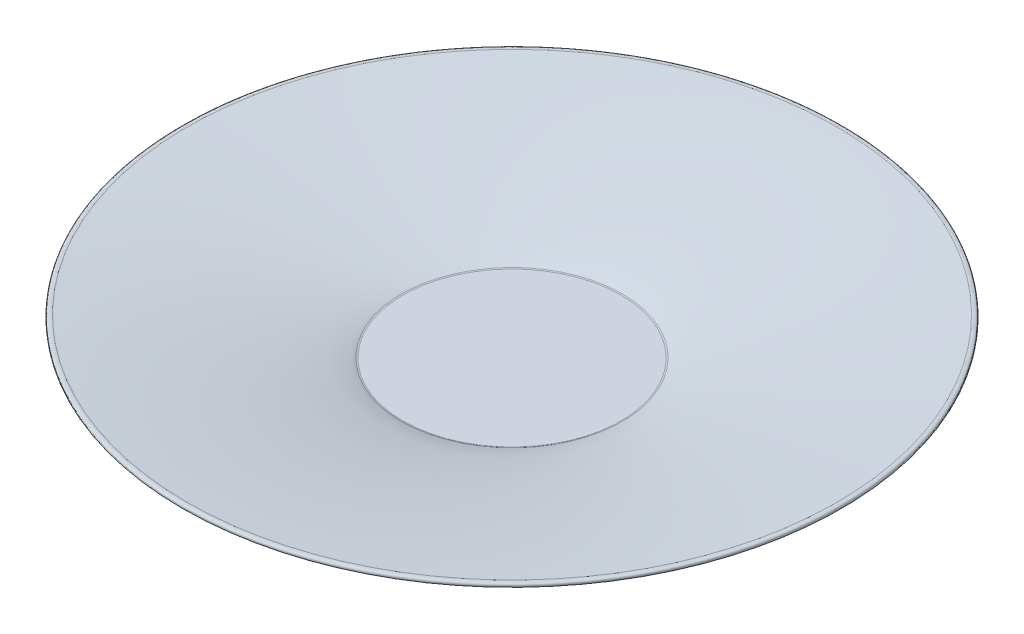
ISO-10303-21;
HEADER;
FILE_DESCRIPTION(('STEP AP214'),'2;1');
FILE_NAME('part.step','',(''),(''),'','','');
FILE_SCHEMA(('AUTOMOTIVE_DESIGN { 1 0 10303 214 1 1 1 1 }'));
ENDSEC;
DATA;
#1=APPLICATION_CONTEXT('core data for automotive mechanical design processes');
#2=APPLICATION_PROTOCOL_DEFINITION('international standard','automotive_design',2000,#1);
#3=PRODUCT_CONTEXT('',#1,'mechanical');
#4=PRODUCT('Part','Part','',(#3));
#5=PRODUCT_RELATED_PRODUCT_CATEGORY('part','',(#4));
#6=PRODUCT_DEFINITION_FORMATION('','',#4);
#7=PRODUCT_DEFINITION_CONTEXT('part definition',#1,'design');
#8=PRODUCT_DEFINITION('design','',#6,#7);
#9=PRODUCT_DEFINITION_SHAPE('','',#8);
#10=(LENGTH_UNIT() NAMED_UNIT(*) SI_UNIT(.MILLI.,.METRE.));
#11=(NAMED_UNIT(*) PLANE_ANGLE_UNIT() SI_UNIT($,.RADIAN.));
#12=(NAMED_UNIT(*) SI_UNIT($,.STERADIAN.) SOLID_ANGLE_UNIT());
#13=UNCERTAINTY_MEASURE_WITH_UNIT(LENGTH_MEASURE(1.E-05),#10,'distance_accuracy_value','');
#14=(GEOMETRIC_REPRESENTATION_CONTEXT(3) GLOBAL_UNCERTAINTY_ASSIGNED_CONTEXT((#13)) GLOBAL_UNIT_ASSIGNED_CONTEXT((#10,
#11,#12)) REPRESENTATION_CONTEXT('',''));
#15=CARTESIAN_POINT('',(0.,0.,0.));
#16=DIRECTION('',(0.,0.,1.));
#17=DIRECTION('',(1.,0.,0.));
#18=AXIS2_PLACEMENT_3D('',#15,#16,#17);
#19=CARTESIAN_POINT('',(74.,8.5333971986131,0.));
#20=CARTESIAN_POINT('',(74.,8.46943015980032,0.));
#21=CARTESIAN_POINT('',(50.,6.3585178789784,0.));
#22=CARTESIAN_POINT('',(28.,1.5609899680195,0.));
#23=CARTESIAN_POINT('',(25.,0.,0.));
#24=B_SPLINE_CURVE_WITH_KNOTS('',4,(#19,#20,#21,#22,#23),.UNSPECIFIED.,.F.,.F.,(5,5),(0.,1.),.UNSPECIFIED.);
#25=CARTESIAN_POINT('',(0.,0.,0.));
#26=DIRECTION('',(0.,1.,0.));
#27=AXIS1_PLACEMENT('',#25,#26);
#28=SURFACE_OF_REVOLUTION('',#24,#27);
#29=CARTESIAN_POINT('',(0.,0.0689929356605954,0.));
#30=DIRECTION('',(0.,1.,0.));
#31=DIRECTION('',(0.,0.,1.));
#32=AXIS2_PLACEMENT_3D('',#29,#30,#31);
#33=CIRCLE('',#32,25.1413428557363);
#34=CARTESIAN_POINT('',(0.,0.0689929356605954,25.1413428557363));
#35=VERTEX_POINT('',#34);
#36=EDGE_CURVE('E51',#35,#35,#33,.F.);
#37=ORIENTED_EDGE('',*,*,#36,.T.);
#38=EDGE_LOOP('',(#37));
#39=FACE_BOUND('',#38,.T.);
#40=CARTESIAN_POINT('',(0.,8.5333971986131,0.));
#41=DIRECTION('',(0.,1.,0.));
#42=DIRECTION('',(0.,0.,1.));
#43=AXIS2_PLACEMENT_3D('',#40,#41,#42);
#44=CIRCLE('',#43,74.);
#45=CARTESIAN_POINT('',(0.,8.5333971986131,74.));
#46=VERTEX_POINT('',#45);
#47=EDGE_CURVE('E63',#46,#46,#44,.T.);
#48=ORIENTED_EDGE('',*,*,#47,.T.);
#49=EDGE_LOOP('',(#48));
#50=FACE_BOUND('',#49,.T.);
#51=ADVANCED_FACE('F31',(#39,#50),#28,.T.);
#52=CARTESIAN_POINT('',(0.,0.,0.));
#53=DIRECTION('',(0.,-1.,0.));
#54=DIRECTION('',(0.,0.,-1.));
#55=AXIS2_PLACEMENT_3D('',#52,#53,#54);
#56=PLANE('',#55);
#57=CARTESIAN_POINT('',(0.,0.,0.));
#58=DIRECTION('',(0.,-1.,0.));
#59=DIRECTION('',(0.,0.,-1.));
#60=AXIS2_PLACEMENT_3D('',#57,#58,#59);
#61=CIRCLE('',#60,24.8271305416557);
#62=CARTESIAN_POINT('',(0.,0.,-24.8271305416557));
#63=VERTEX_POINT('',#62);
#64=EDGE_CURVE('E54',#63,#63,#61,.F.);
#65=ORIENTED_EDGE('',*,*,#64,.T.);
#66=EDGE_LOOP('',(#65));
#67=FACE_BOUND('',#66,.T.);
#68=ADVANCED_FACE('F90',(#67),#56,.F.);
#69=CARTESIAN_POINT('',(25.8,-2.37632158678537,0.));
#70=CARTESIAN_POINT('',(25.,-1.18816079339269,0.));
#71=CARTESIAN_POINT('',(28.3767436675306,0.582613406981976,0.));
#72=CARTESIAN_POINT('',(50.4,4.56627720167923,0.));
#73=CARTESIAN_POINT('',(75.,7.79785949853494,0.));
#74=B_SPLINE_CURVE_WITH_KNOTS('',4,(#69,#70,#71,#72,#73),.UNSPECIFIED.,.F.,.F.,(5,5),(0.,1.),.UNSPECIFIED.);
#75=CARTESIAN_POINT('',(0.,0.,0.));
#76=DIRECTION('',(0.,1.,0.));
#77=AXIS1_PLACEMENT('',#75,#76);
#78=SURFACE_OF_REVOLUTION('',#74,#77);
#79=CARTESIAN_POINT('',(0.,-1.14181524213187,0.));
#80=DIRECTION('',(0.,1.,0.));
#81=DIRECTION('',(0.,0.,1.));
#82=AXIS2_PLACEMENT_3D('',#79,#80,#81);
#83=CIRCLE('',#82,26.7723793104441);
#84=CARTESIAN_POINT('',(0.,-1.14181524213187,26.7723793104441));
#85=VERTEX_POINT('',#84);
#86=EDGE_CURVE('E46',#85,#85,#83,.T.);
#87=ORIENTED_EDGE('',*,*,#86,.T.);
#88=EDGE_LOOP('',(#87));
#89=FACE_BOUND('',#88,.T.);
#90=CARTESIAN_POINT('',(0.,7.79785949853494,0.));
#91=DIRECTION('',(0.,1.,0.));
#92=DIRECTION('',(0.,0.,1.));
#93=AXIS2_PLACEMENT_3D('',#90,#91,#92);
#94=CIRCLE('',#93,75.);
#95=CARTESIAN_POINT('',(0.,7.79785949853494,75.));
#96=VERTEX_POINT('',#95);
#97=EDGE_CURVE('E60',#96,#96,#94,.T.);
#98=ORIENTED_EDGE('',*,*,#97,.F.);
#99=EDGE_LOOP('',(#98));
#100=FACE_BOUND('',#99,.T.);
#101=ADVANCED_FACE('F84',(#89,#100),#78,.T.);
#102=CARTESIAN_POINT('',(75.,7.79785949853494,0.));
#103=CARTESIAN_POINT('',(75.233494481093,8.73624536404964,0.));
#104=CARTESIAN_POINT('',(74.,8.5333971986131,0.));
#105=B_SPLINE_CURVE_WITH_KNOTS('',2,(#102,#103,#104),.UNSPECIFIED.,.F.,.F.,(3,3),(0.,1.),.UNSPECIFIED.);
#106=CARTESIAN_POINT('',(0.,0.,0.));
#107=DIRECTION('',(0.,1.,0.));
#108=AXIS1_PLACEMENT('',#106,#107);
#109=SURFACE_OF_REVOLUTION('',#105,#108);
#110=ORIENTED_EDGE('',*,*,#47,.F.);
#111=EDGE_LOOP('',(#110));
#112=FACE_BOUND('',#111,.T.);
#113=ORIENTED_EDGE('',*,*,#97,.T.);
#114=EDGE_LOOP('',(#113));
#115=FACE_BOUND('',#114,.T.);
#116=ADVANCED_FACE('F79',(#112,#115),#109,.T.);
#117=CARTESIAN_POINT('',(0.,-4.37632158678537,0.));
#118=DIRECTION('',(0.,-1.,0.));
#119=DIRECTION('',(0.,0.,-1.));
#120=AXIS2_PLACEMENT_3D('',#117,#118,#119);
#121=PLANE('',#120);
#122=CARTESIAN_POINT('',(0.,-4.37632158678537,0.));
#123=DIRECTION('',(0.,-1.,0.));
#124=DIRECTION('',(0.,0.,-1.));
#125=AXIS2_PLACEMENT_3D('',#122,#123,#124);
#126=CIRCLE('',#125,27.);
#127=CARTESIAN_POINT('',(0.,-4.37632158678537,-27.));
#128=VERTEX_POINT('',#127);
#129=EDGE_CURVE('E109',#128,#128,#126,.T.);
#130=ORIENTED_EDGE('',*,*,#129,.F.);
#131=EDGE_LOOP('',(#130));
#132=FACE_BOUND('',#131,.T.);
#133=CARTESIAN_POINT('',(0.,-4.37632158678537,0.));
#134=DIRECTION('',(0.,-1.,0.));
#135=DIRECTION('',(0.,0.,-1.));
#136=AXIS2_PLACEMENT_3D('',#133,#134,#135);
#137=CIRCLE('',#136,30.);
#138=CARTESIAN_POINT('',(0.,-4.37632158678537,-30.));
#139=VERTEX_POINT('',#138);
#140=EDGE_CURVE('E66',#139,#139,#137,.T.);
#141=ORIENTED_EDGE('',*,*,#140,.T.);
#142=EDGE_LOOP('',(#141));
#143=FACE_BOUND('',#142,.T.);
#144=ADVANCED_FACE('F83',(#132,#143),#121,.T.);
#145=CARTESIAN_POINT('',(0.,-2.37632158678537,0.));
#146=DIRECTION('',(0.,-1.,0.));
#147=DIRECTION('',(0.,0.,-1.));
#148=AXIS2_PLACEMENT_3D('',#145,#146,#147);
#149=PLANE('',#148);
#150=CARTESIAN_POINT('',(0.,-2.37632158678537,0.));
#151=DIRECTION('',(0.,-1.,0.));
#152=DIRECTION('',(0.,0.,-1.));
#153=AXIS2_PLACEMENT_3D('',#150,#151,#152);
#154=CIRCLE('',#153,27.0567247571455);
#155=CARTESIAN_POINT('',(0.,-2.37632158678537,-27.0567247571455));
#156=VERTEX_POINT('',#155);
#157=EDGE_CURVE('E42',#156,#156,#154,.T.);
#158=ORIENTED_EDGE('',*,*,#157,.T.);
#159=EDGE_LOOP('',(#158));
#160=FACE_BOUND('',#159,.T.);
#161=CARTESIAN_POINT('',(0.,-2.37632158678537,0.));
#162=DIRECTION('',(0.,-1.,0.));
#163=DIRECTION('',(0.,0.,-1.));
#164=AXIS2_PLACEMENT_3D('',#161,#162,#163);
#165=CIRCLE('',#164,27.1715728752538);
#166=CARTESIAN_POINT('',(0.,-2.37632158678537,-27.1715728752538));
#167=VERTEX_POINT('',#166);
#168=EDGE_CURVE('E57',#167,#167,#165,.F.);
#169=ORIENTED_EDGE('',*,*,#168,.T.);
#170=EDGE_LOOP('',(#169));
#171=FACE_BOUND('',#170,.T.);
#172=ADVANCED_FACE('F86',(#160,#171),#149,.F.);
#173=CARTESIAN_POINT('',(0.,-5.37632158678537,0.));
#174=DIRECTION('',(0.,1.,0.));
#175=DIRECTION('',(0.,0.,1.));
#176=AXIS2_PLACEMENT_3D('',#173,#174,#175);
#177=TOROIDAL_SURFACE('',#176,27.1715728752538,3.);
#178=ORIENTED_EDGE('',*,*,#168,.F.);
#179=EDGE_LOOP('',(#178));
#180=FACE_BOUND('',#179,.T.);
#181=ORIENTED_EDGE('',*,*,#140,.F.);
#182=EDGE_LOOP('',(#181));
#183=FACE_BOUND('',#182,.T.);
#184=ADVANCED_FACE('F98',(#180,#183),#177,.T.);
#185=CARTESIAN_POINT('',(0.,0.749999999999999,0.));
#186=DIRECTION('',(0.,1.,0.));
#187=DIRECTION('',(0.,0.,1.));
#188=AXIS2_PLACEMENT_3D('',#185,#186,#187);
#189=TOROIDAL_SURFACE('',#188,24.8271305416557,0.75);
#190=ORIENTED_EDGE('',*,*,#36,.F.);
#191=EDGE_LOOP('',(#190));
#192=FACE_BOUND('',#191,.T.);
#193=ORIENTED_EDGE('',*,*,#64,.F.);
#194=EDGE_LOOP('',(#193));
#195=FACE_BOUND('',#194,.T.);
#196=ADVANCED_FACE('F120',(#192,#195),#189,.F.);
#197=CARTESIAN_POINT('',(0.,-1.72632158678537,0.));
#198=DIRECTION('',(0.,1.,0.));
#199=DIRECTION('',(0.,0.,1.));
#200=AXIS2_PLACEMENT_3D('',#197,#198,#199);
#201=TOROIDAL_SURFACE('',#200,27.0567247571455,0.65);
#202=ORIENTED_EDGE('',*,*,#157,.F.);
#203=EDGE_LOOP('',(#202));
#204=FACE_BOUND('',#203,.T.);
#205=ORIENTED_EDGE('',*,*,#86,.F.);
#206=EDGE_LOOP('',(#205));
#207=FACE_BOUND('',#206,.T.);
#208=ADVANCED_FACE('F126',(#204,#207),#201,.F.);
#209=CARTESIAN_POINT('',(0.,-3.37632158678537,0.));
#210=DIRECTION('',(0.,-1.,0.));
#211=DIRECTION('',(0.,0.,-1.));
#212=AXIS2_PLACEMENT_3D('',#209,#210,#211);
#213=CYLINDRICAL_SURFACE('',#212,27.);
#214=CARTESIAN_POINT('',(0.,-4.02632158678538,0.));
#215=DIRECTION('',(0.,-1.,0.));
#216=DIRECTION('',(0.,0.,-1.));
#217=AXIS2_PLACEMENT_3D('',#214,#215,#216);
#218=CIRCLE('',#217,27.);
#219=CARTESIAN_POINT('',(0.,-4.02632158678538,-27.));
#220=VERTEX_POINT('',#219);
#221=EDGE_CURVE('E10',#220,#220,#218,.F.);
#222=ORIENTED_EDGE('',*,*,#221,.T.);
#223=EDGE_LOOP('',(#222));
#224=FACE_BOUND('',#223,.T.);
#225=ORIENTED_EDGE('',*,*,#129,.T.);
#226=EDGE_LOOP('',(#225));
#227=FACE_BOUND('',#226,.T.);
#228=ADVANCED_FACE('F113',(#224,#227),#213,.F.);
#229=CARTESIAN_POINT('',(0.,-3.37632158678537,0.));
#230=DIRECTION('',(0.,-1.,0.));
#231=DIRECTION('',(0.,0.,-1.));
#232=AXIS2_PLACEMENT_3D('',#229,#230,#231);
#233=PLANE('',#232);
#234=CARTESIAN_POINT('',(0.,-3.37632158678537,0.));
#235=DIRECTION('',(0.,-1.,0.));
#236=DIRECTION('',(0.,0.,-1.));
#237=AXIS2_PLACEMENT_3D('',#234,#235,#236);
#238=CIRCLE('',#237,26.35);
#239=CARTESIAN_POINT('',(0.,-3.37632158678537,-26.35));
#240=VERTEX_POINT('',#239);
#241=EDGE_CURVE('E38',#240,#240,#238,.T.);
#242=ORIENTED_EDGE('',*,*,#241,.T.);
#243=EDGE_LOOP('',(#242));
#244=FACE_BOUND('',#243,.T.);
#245=ADVANCED_FACE('F144',(#244),#233,.T.);
#246=CARTESIAN_POINT('',(0.,-4.02632158678538,0.));
#247=DIRECTION('',(0.,-1.,0.));
#248=DIRECTION('',(0.,0.,-1.));
#249=AXIS2_PLACEMENT_3D('',#246,#247,#248);
#250=TOROIDAL_SURFACE('',#249,26.35,0.65);
#251=ORIENTED_EDGE('',*,*,#221,.F.);
#252=EDGE_LOOP('',(#251));
#253=FACE_BOUND('',#252,.T.);
#254=ORIENTED_EDGE('',*,*,#241,.F.);
#255=EDGE_LOOP('',(#254));
#256=FACE_BOUND('',#255,.T.);
#257=ADVANCED_FACE('F33',(#253,#256),#250,.F.);
#258=CLOSED_SHELL('',(#51,#68,#101,#116,#144,#172,#184,#196,#208,#228,#245,#257));
#259=MANIFOLD_SOLID_BREP('B2',#258);
#260=ADVANCED_BREP_SHAPE_REPRESENTATION('',(#18,#259),#14);
#261=SHAPE_DEFINITION_REPRESENTATION(#9,#260);
ENDSEC;
END-ISO-10303-21;
